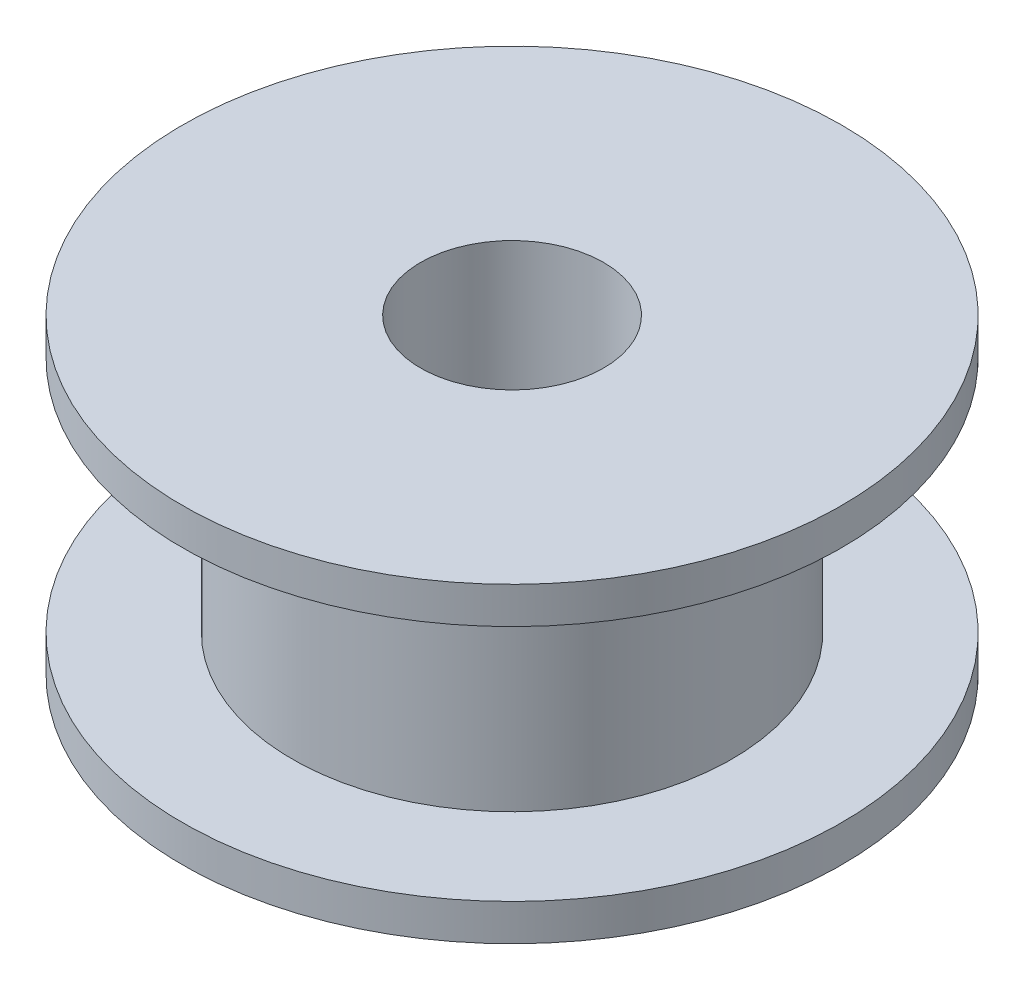
ISO-10303-21;
HEADER;
FILE_DESCRIPTION(('STEP AP214'),'2;1');
FILE_NAME('part.step','',(''),(''),'','','');
FILE_SCHEMA(('AUTOMOTIVE_DESIGN { 1 0 10303 214 1 1 1 1 }'));
ENDSEC;
DATA;
#1=APPLICATION_CONTEXT('core data for automotive mechanical design processes');
#2=APPLICATION_PROTOCOL_DEFINITION('international standard','automotive_design',2000,#1);
#3=PRODUCT_CONTEXT('',#1,'mechanical');
#4=PRODUCT('Part','Part','',(#3));
#5=PRODUCT_RELATED_PRODUCT_CATEGORY('part','',(#4));
#6=PRODUCT_DEFINITION_FORMATION('','',#4);
#7=PRODUCT_DEFINITION_CONTEXT('part definition',#1,'design');
#8=PRODUCT_DEFINITION('design','',#6,#7);
#9=PRODUCT_DEFINITION_SHAPE('','',#8);
#10=(LENGTH_UNIT() NAMED_UNIT(*) SI_UNIT(.MILLI.,.METRE.));
#11=(NAMED_UNIT(*) PLANE_ANGLE_UNIT() SI_UNIT($,.RADIAN.));
#12=(NAMED_UNIT(*) SI_UNIT($,.STERADIAN.) SOLID_ANGLE_UNIT());
#13=UNCERTAINTY_MEASURE_WITH_UNIT(LENGTH_MEASURE(1.E-05),#10,'distance_accuracy_value','');
#14=(GEOMETRIC_REPRESENTATION_CONTEXT(3) GLOBAL_UNCERTAINTY_ASSIGNED_CONTEXT((#13)) GLOBAL_UNIT_ASSIGNED_CONTEXT((#10,
#11,#12)) REPRESENTATION_CONTEXT('',''));
#15=CARTESIAN_POINT('',(0.,0.,0.));
#16=DIRECTION('',(0.,0.,1.));
#17=DIRECTION('',(1.,0.,0.));
#18=AXIS2_PLACEMENT_3D('',#15,#16,#17);
#19=CARTESIAN_POINT('',(0.,0.,0.));
#20=DIRECTION('',(0.,-1.,0.));
#21=DIRECTION('',(0.,0.,-1.));
#22=AXIS2_PLACEMENT_3D('',#19,#20,#21);
#23=CYLINDRICAL_SURFACE('',#22,2.5);
#24=CARTESIAN_POINT('',(0.,8.5,0.));
#25=DIRECTION('',(0.,-1.,0.));
#26=DIRECTION('',(0.,0.,-1.));
#27=AXIS2_PLACEMENT_3D('',#24,#25,#26);
#28=CIRCLE('',#27,2.5);
#29=CARTESIAN_POINT('',(0.,8.5,-2.5));
#30=VERTEX_POINT('',#29);
#31=EDGE_CURVE('E10',#30,#30,#28,.T.);
#32=ORIENTED_EDGE('',*,*,#31,.F.);
#33=EDGE_LOOP('',(#32));
#34=FACE_BOUND('',#33,.T.);
#35=CARTESIAN_POINT('',(0.,0.,0.));
#36=DIRECTION('',(0.,-1.,0.));
#37=DIRECTION('',(0.,0.,-1.));
#38=AXIS2_PLACEMENT_3D('',#35,#36,#37);
#39=CIRCLE('',#38,2.5);
#40=CARTESIAN_POINT('',(0.,0.,-2.5));
#41=VERTEX_POINT('',#40);
#42=EDGE_CURVE('E67',#41,#41,#39,.T.);
#43=ORIENTED_EDGE('',*,*,#42,.T.);
#44=EDGE_LOOP('',(#43));
#45=FACE_BOUND('',#44,.T.);
#46=ADVANCED_FACE('F39',(#34,#45),#23,.F.);
#47=CARTESIAN_POINT('',(-6.,8.5,0.));
#48=DIRECTION('',(0.,-1.,0.));
#49=DIRECTION('',(0.,0.,-1.));
#50=AXIS2_PLACEMENT_3D('',#47,#48,#49);
#51=PLANE('',#50);
#52=CARTESIAN_POINT('',(0.,8.5,0.));
#53=DIRECTION('',(0.,-1.,0.));
#54=DIRECTION('',(0.,0.,-1.));
#55=AXIS2_PLACEMENT_3D('',#52,#53,#54);
#56=CIRCLE('',#55,9.);
#57=CARTESIAN_POINT('',(0.,8.5,-9.));
#58=VERTEX_POINT('',#57);
#59=EDGE_CURVE('E45',#58,#58,#56,.T.);
#60=ORIENTED_EDGE('',*,*,#59,.F.);
#61=EDGE_LOOP('',(#60));
#62=FACE_BOUND('',#61,.T.);
#63=ORIENTED_EDGE('',*,*,#31,.T.);
#64=EDGE_LOOP('',(#63));
#65=FACE_BOUND('',#64,.T.);
#66=ADVANCED_FACE('F104',(#62,#65),#51,.F.);
#67=CARTESIAN_POINT('',(0.,0.,0.));
#68=DIRECTION('',(0.,-1.,0.));
#69=DIRECTION('',(0.,0.,-1.));
#70=AXIS2_PLACEMENT_3D('',#67,#68,#69);
#71=CYLINDRICAL_SURFACE('',#70,9.);
#72=CARTESIAN_POINT('',(0.,7.5,0.));
#73=DIRECTION('',(0.,-1.,0.));
#74=DIRECTION('',(0.,0.,-1.));
#75=AXIS2_PLACEMENT_3D('',#72,#73,#74);
#76=CIRCLE('',#75,9.);
#77=CARTESIAN_POINT('',(0.,7.5,-9.));
#78=VERTEX_POINT('',#77);
#79=EDGE_CURVE('E49',#78,#78,#76,.T.);
#80=ORIENTED_EDGE('',*,*,#79,.F.);
#81=EDGE_LOOP('',(#80));
#82=FACE_BOUND('',#81,.T.);
#83=ORIENTED_EDGE('',*,*,#59,.T.);
#84=EDGE_LOOP('',(#83));
#85=FACE_BOUND('',#84,.T.);
#86=ADVANCED_FACE('F99',(#82,#85),#71,.T.);
#87=CARTESIAN_POINT('',(-6.,7.5,0.));
#88=DIRECTION('',(0.,1.,0.));
#89=DIRECTION('',(0.,0.,1.));
#90=AXIS2_PLACEMENT_3D('',#87,#88,#89);
#91=PLANE('',#90);
#92=CARTESIAN_POINT('',(0.,7.5,0.));
#93=DIRECTION('',(0.,-1.,0.));
#94=DIRECTION('',(0.,0.,-1.));
#95=AXIS2_PLACEMENT_3D('',#92,#93,#94);
#96=CIRCLE('',#95,6.);
#97=CARTESIAN_POINT('',(0.,7.5,-6.));
#98=VERTEX_POINT('',#97);
#99=EDGE_CURVE('E53',#98,#98,#96,.T.);
#100=ORIENTED_EDGE('',*,*,#99,.F.);
#101=EDGE_LOOP('',(#100));
#102=FACE_BOUND('',#101,.T.);
#103=ORIENTED_EDGE('',*,*,#79,.T.);
#104=EDGE_LOOP('',(#103));
#105=FACE_BOUND('',#104,.T.);
#106=ADVANCED_FACE('F93',(#102,#105),#91,.F.);
#107=CARTESIAN_POINT('',(0.,0.,0.));
#108=DIRECTION('',(0.,-1.,0.));
#109=DIRECTION('',(0.,0.,-1.));
#110=AXIS2_PLACEMENT_3D('',#107,#108,#109);
#111=CYLINDRICAL_SURFACE('',#110,6.);
#112=CARTESIAN_POINT('',(0.,1.,0.));
#113=DIRECTION('',(0.,-1.,0.));
#114=DIRECTION('',(0.,0.,-1.));
#115=AXIS2_PLACEMENT_3D('',#112,#113,#114);
#116=CIRCLE('',#115,6.);
#117=CARTESIAN_POINT('',(0.,1.,-6.));
#118=VERTEX_POINT('',#117);
#119=EDGE_CURVE('E58',#118,#118,#116,.T.);
#120=ORIENTED_EDGE('',*,*,#119,.F.);
#121=EDGE_LOOP('',(#120));
#122=FACE_BOUND('',#121,.T.);
#123=ORIENTED_EDGE('',*,*,#99,.T.);
#124=EDGE_LOOP('',(#123));
#125=FACE_BOUND('',#124,.T.);
#126=ADVANCED_FACE('F87',(#122,#125),#111,.T.);
#127=CARTESIAN_POINT('',(-6.,1.,0.));
#128=DIRECTION('',(0.,-1.,0.));
#129=DIRECTION('',(0.,0.,-1.));
#130=AXIS2_PLACEMENT_3D('',#127,#128,#129);
#131=PLANE('',#130);
#132=CARTESIAN_POINT('',(0.,1.,0.));
#133=DIRECTION('',(0.,-1.,0.));
#134=DIRECTION('',(0.,0.,-1.));
#135=AXIS2_PLACEMENT_3D('',#132,#133,#134);
#136=CIRCLE('',#135,9.);
#137=CARTESIAN_POINT('',(0.,1.,-9.));
#138=VERTEX_POINT('',#137);
#139=EDGE_CURVE('E61',#138,#138,#136,.T.);
#140=ORIENTED_EDGE('',*,*,#139,.F.);
#141=EDGE_LOOP('',(#140));
#142=FACE_BOUND('',#141,.T.);
#143=ORIENTED_EDGE('',*,*,#119,.T.);
#144=EDGE_LOOP('',(#143));
#145=FACE_BOUND('',#144,.T.);
#146=ADVANCED_FACE('F81',(#142,#145),#131,.F.);
#147=CARTESIAN_POINT('',(0.,0.,0.));
#148=DIRECTION('',(0.,-1.,0.));
#149=DIRECTION('',(0.,0.,-1.));
#150=AXIS2_PLACEMENT_3D('',#147,#148,#149);
#151=CYLINDRICAL_SURFACE('',#150,9.);
#152=CARTESIAN_POINT('',(0.,0.,0.));
#153=DIRECTION('',(0.,-1.,0.));
#154=DIRECTION('',(0.,0.,-1.));
#155=AXIS2_PLACEMENT_3D('',#152,#153,#154);
#156=CIRCLE('',#155,9.);
#157=CARTESIAN_POINT('',(0.,0.,-9.));
#158=VERTEX_POINT('',#157);
#159=EDGE_CURVE('E64',#158,#158,#156,.T.);
#160=ORIENTED_EDGE('',*,*,#159,.F.);
#161=EDGE_LOOP('',(#160));
#162=FACE_BOUND('',#161,.T.);
#163=ORIENTED_EDGE('',*,*,#139,.T.);
#164=EDGE_LOOP('',(#163));
#165=FACE_BOUND('',#164,.T.);
#166=ADVANCED_FACE('F75',(#162,#165),#151,.T.);
#167=CARTESIAN_POINT('',(-2.5,0.,0.));
#168=DIRECTION('',(0.,1.,0.));
#169=DIRECTION('',(0.,0.,1.));
#170=AXIS2_PLACEMENT_3D('',#167,#168,#169);
#171=PLANE('',#170);
#172=ORIENTED_EDGE('',*,*,#42,.F.);
#173=EDGE_LOOP('',(#172));
#174=FACE_BOUND('',#173,.T.);
#175=ORIENTED_EDGE('',*,*,#159,.T.);
#176=EDGE_LOOP('',(#175));
#177=FACE_BOUND('',#176,.T.);
#178=ADVANCED_FACE('F72',(#174,#177),#171,.F.);
#179=CLOSED_SHELL('',(#46,#66,#86,#106,#126,#146,#166,#178));
#180=MANIFOLD_SOLID_BREP('B2',#179);
#181=ADVANCED_BREP_SHAPE_REPRESENTATION('',(#18,#180),#14);
#182=SHAPE_DEFINITION_REPRESENTATION(#9,#181);
ENDSEC;
END-ISO-10303-21;
